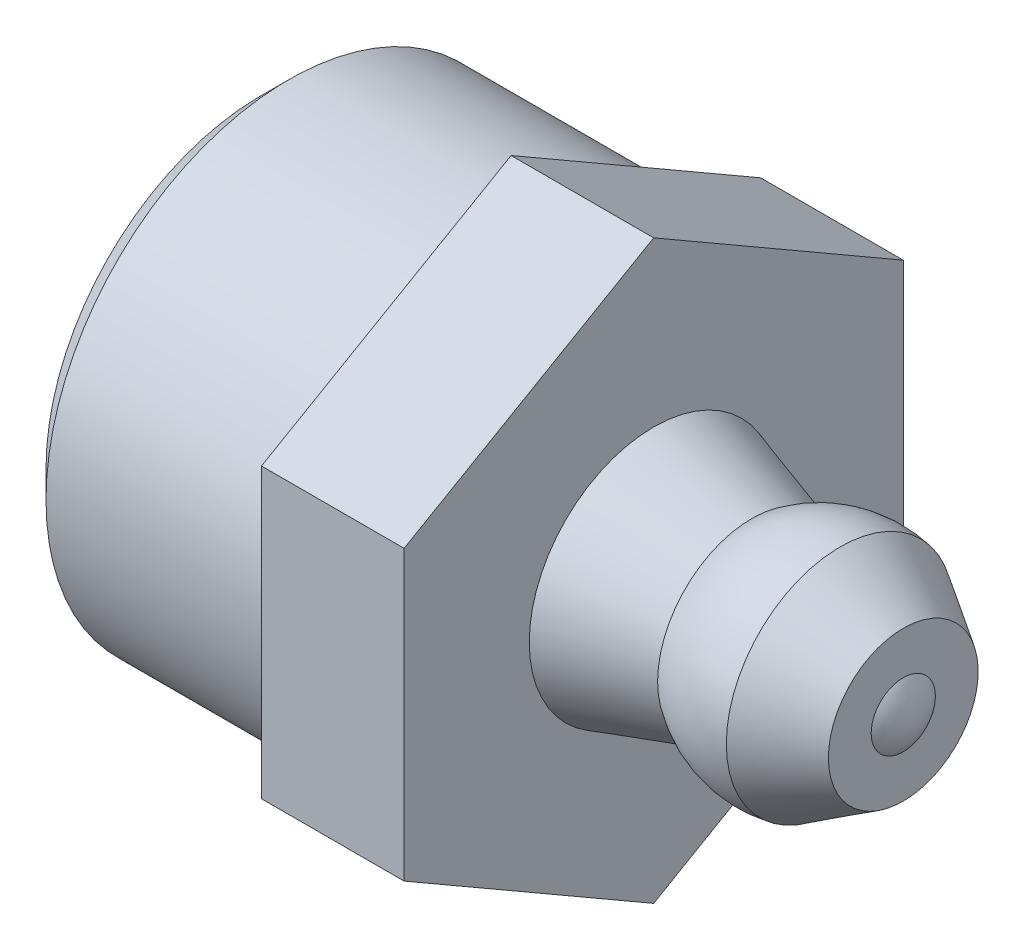
ISO-10303-21;
HEADER;
FILE_DESCRIPTION(('STEP AP214'),'2;1');
FILE_NAME('part.step','',(''),(''),'','','');
FILE_SCHEMA(('AUTOMOTIVE_DESIGN { 1 0 10303 214 1 1 1 1 }'));
ENDSEC;
DATA;
#1=APPLICATION_CONTEXT('core data for automotive mechanical design processes');
#2=APPLICATION_PROTOCOL_DEFINITION('international standard','automotive_design',2000,#1);
#3=PRODUCT_CONTEXT('',#1,'mechanical');
#4=PRODUCT('Part','Part','',(#3));
#5=PRODUCT_RELATED_PRODUCT_CATEGORY('part','',(#4));
#6=PRODUCT_DEFINITION_FORMATION('','',#4);
#7=PRODUCT_DEFINITION_CONTEXT('part definition',#1,'design');
#8=PRODUCT_DEFINITION('design','',#6,#7);
#9=PRODUCT_DEFINITION_SHAPE('','',#8);
#10=(LENGTH_UNIT() NAMED_UNIT(*) SI_UNIT(.MILLI.,.METRE.));
#11=(NAMED_UNIT(*) PLANE_ANGLE_UNIT() SI_UNIT($,.RADIAN.));
#12=(NAMED_UNIT(*) SI_UNIT($,.STERADIAN.) SOLID_ANGLE_UNIT());
#13=UNCERTAINTY_MEASURE_WITH_UNIT(LENGTH_MEASURE(1.E-05),#10,'distance_accuracy_value','');
#14=(GEOMETRIC_REPRESENTATION_CONTEXT(3) GLOBAL_UNCERTAINTY_ASSIGNED_CONTEXT((#13)) GLOBAL_UNIT_ASSIGNED_CONTEXT((#10,
#11,#12)) REPRESENTATION_CONTEXT('',''));
#15=CARTESIAN_POINT('',(0.,0.,0.));
#16=DIRECTION('',(0.,0.,1.));
#17=DIRECTION('',(1.,0.,0.));
#18=AXIS2_PLACEMENT_3D('',#15,#16,#17);
#19=CARTESIAN_POINT('',(9.80000000000003,0.,0.));
#20=DIRECTION('',(-1.,0.,0.));
#21=DIRECTION('',(0.,1.,0.));
#22=AXIS2_PLACEMENT_3D('',#19,#20,#21);
#23=SPHERICAL_SURFACE('',#22,1.5);
#24=CARTESIAN_POINT('',(10.9999999999999,0.,0.));
#25=DIRECTION('',(-1.,0.,0.));
#26=DIRECTION('',(0.,0.,1.));
#27=AXIS2_PLACEMENT_3D('',#24,#25,#26);
#28=CIRCLE('',#27,0.9);
#29=CARTESIAN_POINT('',(10.9999999999999,0.,0.9));
#30=VERTEX_POINT('',#29);
#31=EDGE_CURVE('E11',#30,#30,#28,.T.);
#32=ORIENTED_EDGE('',*,*,#31,.F.);
#33=EDGE_LOOP('',(#32));
#34=FACE_BOUND('',#33,.T.);
#35=ADVANCED_FACE('F17',(#34),#23,.T.);
#36=CARTESIAN_POINT('',(10.9999999999999,0.900000000000012,0.));
#37=DIRECTION('',(-1.,0.,0.));
#38=DIRECTION('',(0.,0.,1.));
#39=AXIS2_PLACEMENT_3D('',#36,#37,#38);
#40=PLANE('',#39);
#41=CARTESIAN_POINT('',(10.9999999999999,0.,0.));
#42=DIRECTION('',(-1.,0.,0.));
#43=DIRECTION('',(0.,0.,1.));
#44=AXIS2_PLACEMENT_3D('',#41,#42,#43);
#45=CIRCLE('',#44,2.1);
#46=CARTESIAN_POINT('',(10.9999999999999,0.,2.1));
#47=VERTEX_POINT('',#46);
#48=EDGE_CURVE('E26',#47,#47,#45,.T.);
#49=ORIENTED_EDGE('',*,*,#48,.F.);
#50=EDGE_LOOP('',(#49));
#51=FACE_BOUND('',#50,.T.);
#52=ORIENTED_EDGE('',*,*,#31,.T.);
#53=EDGE_LOOP('',(#52));
#54=FACE_BOUND('',#53,.T.);
#55=ADVANCED_FACE('F138',(#51,#54),#40,.F.);
#56=CARTESIAN_POINT('',(10.9999999999999,0.,0.));
#57=DIRECTION('',(-1.,0.,0.));
#58=DIRECTION('',(0.,0.,1.));
#59=AXIS2_PLACEMENT_3D('',#56,#57,#58);
#60=CONICAL_SURFACE('',#59,2.1,0.554038706826685);
#61=CARTESIAN_POINT('',(9.23148877199997,0.,0.));
#62=DIRECTION('',(-1.,0.,0.));
#63=DIRECTION('',(0.,0.,1.));
#64=AXIS2_PLACEMENT_3D('',#61,#62,#63);
#65=CIRCLE('',#64,3.194135251);
#66=CARTESIAN_POINT('',(9.23148877199997,0.,3.194135251));
#67=VERTEX_POINT('',#66);
#68=EDGE_CURVE('E126',#67,#67,#65,.T.);
#69=ORIENTED_EDGE('',*,*,#68,.F.);
#70=EDGE_LOOP('',(#69));
#71=FACE_BOUND('',#70,.T.);
#72=ORIENTED_EDGE('',*,*,#48,.T.);
#73=EDGE_LOOP('',(#72));
#74=FACE_BOUND('',#73,.T.);
#75=ADVANCED_FACE('F136',(#71,#74),#60,.T.);
#76=CARTESIAN_POINT('',(8.64260971425135,0.,0.));
#77=DIRECTION('',(-1.,0.,0.));
#78=DIRECTION('',(0.,0.,1.));
#79=AXIS2_PLACEMENT_3D('',#76,#77,#78);
#80=DEGENERATE_TOROIDAL_SURFACE('',#79,0.00206897516345217,3.25,.F.);
#81=CARTESIAN_POINT('',(6.75000000000003,0.,0.));
#82=DIRECTION('',(-1.,0.,0.));
#83=DIRECTION('',(0.,0.,1.));
#84=AXIS2_PLACEMENT_3D('',#81,#82,#83);
#85=CIRCLE('',#84,2.64);
#86=CARTESIAN_POINT('',(6.75000000000003,0.,2.64));
#87=VERTEX_POINT('',#86);
#88=EDGE_CURVE('E122',#87,#87,#85,.T.);
#89=ORIENTED_EDGE('',*,*,#88,.F.);
#90=EDGE_LOOP('',(#89));
#91=FACE_BOUND('',#90,.T.);
#92=ORIENTED_EDGE('',*,*,#68,.T.);
#93=EDGE_LOOP('',(#92));
#94=FACE_BOUND('',#93,.T.);
#95=ADVANCED_FACE('F151',(#91,#94),#80,.F.);
#96=CARTESIAN_POINT('',(4.,0.,0.));
#97=DIRECTION('',(-1.,0.,0.));
#98=DIRECTION('',(0.,0.,1.));
#99=AXIS2_PLACEMENT_3D('',#96,#97,#98);
#100=CONICAL_SURFACE('',#99,3.49,0.29977607009998);
#101=ORIENTED_EDGE('',*,*,#88,.T.);
#102=EDGE_LOOP('',(#101));
#103=FACE_BOUND('',#102,.T.);
#104=CARTESIAN_POINT('',(4.,0.,0.));
#105=DIRECTION('',(-1.,0.,0.));
#106=DIRECTION('',(0.,0.,1.));
#107=AXIS2_PLACEMENT_3D('',#104,#105,#106);
#108=CIRCLE('',#107,3.49);
#109=CARTESIAN_POINT('',(4.,0.,3.49));
#110=VERTEX_POINT('',#109);
#111=EDGE_CURVE('E118',#110,#110,#108,.T.);
#112=ORIENTED_EDGE('',*,*,#111,.F.);
#113=EDGE_LOOP('',(#112));
#114=FACE_BOUND('',#113,.T.);
#115=ADVANCED_FACE('F155',(#103,#114),#100,.T.);
#116=CARTESIAN_POINT('',(4.,7.00000000000001,0.));
#117=DIRECTION('',(1.,0.,0.));
#118=DIRECTION('',(0.,0.,-1.));
#119=AXIS2_PLACEMENT_3D('',#116,#117,#118);
#120=PLANE('',#119);
#121=ORIENTED_EDGE('',*,*,#111,.T.);
#122=EDGE_LOOP('',(#121));
#123=FACE_BOUND('',#122,.T.);
#124=DIRECTION('',(0.,-0.5,0.866025403784439));
#125=VECTOR('',#124,1.);
#126=CARTESIAN_POINT('',(4.,8.08290376865475,0.));
#127=LINE('',#126,#125);
#128=CARTESIAN_POINT('',(4.,8.08290376865475,0.));
#129=VERTEX_POINT('',#128);
#130=CARTESIAN_POINT('',(4.,4.04145188432739,7.));
#131=VERTEX_POINT('',#130);
#132=EDGE_CURVE('E38',#129,#131,#127,.T.);
#133=ORIENTED_EDGE('',*,*,#132,.T.);
#134=DIRECTION('',(0.,-1.,0.));
#135=VECTOR('',#134,1.);
#136=CARTESIAN_POINT('',(4.,4.04145188432739,7.));
#137=LINE('',#136,#135);
#138=CARTESIAN_POINT('',(4.,-4.04145188432736,7.));
#139=VERTEX_POINT('',#138);
#140=EDGE_CURVE('E33',#131,#139,#137,.T.);
#141=ORIENTED_EDGE('',*,*,#140,.T.);
#142=DIRECTION('',(0.,-0.5,-0.866025403784438));
#143=VECTOR('',#142,1.);
#144=CARTESIAN_POINT('',(4.,-4.04145188432736,7.));
#145=LINE('',#144,#143);
#146=CARTESIAN_POINT('',(4.,-8.08290376865475,0.));
#147=VERTEX_POINT('',#146);
#148=EDGE_CURVE('E203',#139,#147,#145,.T.);
#149=ORIENTED_EDGE('',*,*,#148,.T.);
#150=DIRECTION('',(0.,0.5,-0.866025403784439));
#151=VECTOR('',#150,1.);
#152=CARTESIAN_POINT('',(4.,-8.08290376865475,0.));
#153=LINE('',#152,#151);
#154=CARTESIAN_POINT('',(4.,-4.04145188432739,-7.));
#155=VERTEX_POINT('',#154);
#156=EDGE_CURVE('E94',#147,#155,#153,.T.);
#157=ORIENTED_EDGE('',*,*,#156,.T.);
#158=DIRECTION('',(0.,1.,0.));
#159=VECTOR('',#158,1.);
#160=CARTESIAN_POINT('',(4.,-4.04145188432739,-7.));
#161=LINE('',#160,#159);
#162=CARTESIAN_POINT('',(4.,4.04145188432739,-7.));
#163=VERTEX_POINT('',#162);
#164=EDGE_CURVE('E218',#155,#163,#161,.T.);
#165=ORIENTED_EDGE('',*,*,#164,.T.);
#166=DIRECTION('',(0.,0.5,0.866025403784439));
#167=VECTOR('',#166,1.);
#168=CARTESIAN_POINT('',(4.,4.04145188432739,-7.));
#169=LINE('',#168,#167);
#170=EDGE_CURVE('E221',#163,#129,#169,.T.);
#171=ORIENTED_EDGE('',*,*,#170,.T.);
#172=EDGE_LOOP('',(#133,#141,#149,#157,#165,#171));
#173=FACE_BOUND('',#172,.T.);
#174=ADVANCED_FACE('F159',(#123,#173),#120,.T.);
#175=CARTESIAN_POINT('',(4.,-4.04145188432736,7.));
#176=DIRECTION('',(0.,0.866025403784438,-0.5));
#177=DIRECTION('',(0.,0.5,0.866025403784439));
#178=AXIS2_PLACEMENT_3D('',#175,#176,#177);
#179=PLANE('',#178);
#180=DIRECTION('',(0.,-0.5,-0.866025403784438));
#181=VECTOR('',#180,1.);
#182=CARTESIAN_POINT('',(0.,-4.04145188432736,7.));
#183=LINE('',#182,#181);
#184=CARTESIAN_POINT('',(0.,-4.04145188432736,7.));
#185=VERTEX_POINT('',#184);
#186=CARTESIAN_POINT('',(0.,-8.08290376865475,0.));
#187=VERTEX_POINT('',#186);
#188=EDGE_CURVE('E70',#185,#187,#183,.T.);
#189=ORIENTED_EDGE('',*,*,#188,.T.);
#190=DIRECTION('',(-1.,0.,0.));
#191=VECTOR('',#190,1.);
#192=CARTESIAN_POINT('',(4.,-8.08290376865475,0.));
#193=LINE('',#192,#191);
#194=EDGE_CURVE('E75',#147,#187,#193,.T.);
#195=ORIENTED_EDGE('',*,*,#194,.F.);
#196=ORIENTED_EDGE('',*,*,#148,.F.);
#197=DIRECTION('',(-1.,0.,0.));
#198=VECTOR('',#197,1.);
#199=CARTESIAN_POINT('',(4.,-4.04145188432736,7.));
#200=LINE('',#199,#198);
#201=EDGE_CURVE('E76',#139,#185,#200,.T.);
#202=ORIENTED_EDGE('',*,*,#201,.T.);
#203=EDGE_LOOP('',(#189,#195,#196,#202));
#204=FACE_BOUND('',#203,.T.);
#205=ADVANCED_FACE('F72',(#204),#179,.F.);
#206=CARTESIAN_POINT('',(4.,-8.08290376865475,0.));
#207=DIRECTION('',(0.,0.866025403784439,0.5));
#208=DIRECTION('',(0.,-0.5,0.866025403784439));
#209=AXIS2_PLACEMENT_3D('',#206,#207,#208);
#210=PLANE('',#209);
#211=DIRECTION('',(0.,0.5,-0.866025403784439));
#212=VECTOR('',#211,1.);
#213=CARTESIAN_POINT('',(0.,-8.08290376865475,0.));
#214=LINE('',#213,#212);
#215=CARTESIAN_POINT('',(0.,-4.04145188432739,-7.));
#216=VERTEX_POINT('',#215);
#217=EDGE_CURVE('E80',#187,#216,#214,.T.);
#218=ORIENTED_EDGE('',*,*,#217,.T.);
#219=DIRECTION('',(-1.,0.,0.));
#220=VECTOR('',#219,1.);
#221=CARTESIAN_POINT('',(4.,-4.04145188432739,-7.));
#222=LINE('',#221,#220);
#223=EDGE_CURVE('E97',#155,#216,#222,.T.);
#224=ORIENTED_EDGE('',*,*,#223,.F.);
#225=ORIENTED_EDGE('',*,*,#156,.F.);
#226=ORIENTED_EDGE('',*,*,#194,.T.);
#227=EDGE_LOOP('',(#218,#224,#225,#226));
#228=FACE_BOUND('',#227,.T.);
#229=ADVANCED_FACE('F93',(#228),#210,.F.);
#230=CARTESIAN_POINT('',(4.,-4.04145188432739,-7.));
#231=DIRECTION('',(0.,0.,1.));
#232=DIRECTION('',(0.,-1.,0.));
#233=AXIS2_PLACEMENT_3D('',#230,#231,#232);
#234=PLANE('',#233);
#235=DIRECTION('',(0.,1.,0.));
#236=VECTOR('',#235,1.);
#237=CARTESIAN_POINT('',(0.,-4.04145188432739,-7.));
#238=LINE('',#237,#236);
#239=CARTESIAN_POINT('',(0.,4.04145188432739,-7.));
#240=VERTEX_POINT('',#239);
#241=EDGE_CURVE('E86',#216,#240,#238,.T.);
#242=ORIENTED_EDGE('',*,*,#241,.T.);
#243=DIRECTION('',(-1.,0.,0.));
#244=VECTOR('',#243,1.);
#245=CARTESIAN_POINT('',(4.,4.04145188432739,-7.));
#246=LINE('',#245,#244);
#247=EDGE_CURVE('E107',#163,#240,#246,.T.);
#248=ORIENTED_EDGE('',*,*,#247,.F.);
#249=ORIENTED_EDGE('',*,*,#164,.F.);
#250=ORIENTED_EDGE('',*,*,#223,.T.);
#251=EDGE_LOOP('',(#242,#248,#249,#250));
#252=FACE_BOUND('',#251,.T.);
#253=ADVANCED_FACE('F178',(#252),#234,.F.);
#254=CARTESIAN_POINT('',(4.,4.04145188432739,-7.));
#255=DIRECTION('',(0.,-0.866025403784439,0.5));
#256=DIRECTION('',(0.,-0.5,-0.866025403784439));
#257=AXIS2_PLACEMENT_3D('',#254,#255,#256);
#258=PLANE('',#257);
#259=DIRECTION('',(0.,0.5,0.866025403784439));
#260=VECTOR('',#259,1.);
#261=CARTESIAN_POINT('',(0.,4.04145188432739,-7.));
#262=LINE('',#261,#260);
#263=CARTESIAN_POINT('',(0.,8.08290376865475,0.));
#264=VERTEX_POINT('',#263);
#265=EDGE_CURVE('E212',#240,#264,#262,.T.);
#266=ORIENTED_EDGE('',*,*,#265,.T.);
#267=DIRECTION('',(-1.,0.,0.));
#268=VECTOR('',#267,1.);
#269=CARTESIAN_POINT('',(4.,8.08290376865475,0.));
#270=LINE('',#269,#268);
#271=EDGE_CURVE('E231',#129,#264,#270,.T.);
#272=ORIENTED_EDGE('',*,*,#271,.F.);
#273=ORIENTED_EDGE('',*,*,#170,.F.);
#274=ORIENTED_EDGE('',*,*,#247,.T.);
#275=EDGE_LOOP('',(#266,#272,#273,#274));
#276=FACE_BOUND('',#275,.T.);
#277=ADVANCED_FACE('F181',(#276),#258,.F.);
#278=CARTESIAN_POINT('',(4.,8.08290376865475,0.));
#279=DIRECTION('',(0.,-0.866025403784439,-0.5));
#280=DIRECTION('',(0.,0.5,-0.866025403784439));
#281=AXIS2_PLACEMENT_3D('',#278,#279,#280);
#282=PLANE('',#281);
#283=DIRECTION('',(0.,-0.5,0.866025403784439));
#284=VECTOR('',#283,1.);
#285=CARTESIAN_POINT('',(0.,8.08290376865475,0.));
#286=LINE('',#285,#284);
#287=CARTESIAN_POINT('',(0.,4.04145188432739,7.));
#288=VERTEX_POINT('',#287);
#289=EDGE_CURVE('E204',#264,#288,#286,.T.);
#290=ORIENTED_EDGE('',*,*,#289,.T.);
#291=DIRECTION('',(-1.,0.,0.));
#292=VECTOR('',#291,1.);
#293=CARTESIAN_POINT('',(4.,4.04145188432739,7.));
#294=LINE('',#293,#292);
#295=EDGE_CURVE('E200',#131,#288,#294,.T.);
#296=ORIENTED_EDGE('',*,*,#295,.F.);
#297=ORIENTED_EDGE('',*,*,#132,.F.);
#298=ORIENTED_EDGE('',*,*,#271,.T.);
#299=EDGE_LOOP('',(#290,#296,#297,#298));
#300=FACE_BOUND('',#299,.T.);
#301=ADVANCED_FACE('F185',(#300),#282,.F.);
#302=CARTESIAN_POINT('',(4.,4.04145188432739,7.));
#303=DIRECTION('',(0.,0.,-1.));
#304=DIRECTION('',(0.,1.,0.));
#305=AXIS2_PLACEMENT_3D('',#302,#303,#304);
#306=PLANE('',#305);
#307=DIRECTION('',(0.,-1.,0.));
#308=VECTOR('',#307,1.);
#309=CARTESIAN_POINT('',(0.,4.04145188432739,7.));
#310=LINE('',#309,#308);
#311=EDGE_CURVE('E198',#288,#185,#310,.T.);
#312=ORIENTED_EDGE('',*,*,#311,.T.);
#313=ORIENTED_EDGE('',*,*,#201,.F.);
#314=ORIENTED_EDGE('',*,*,#140,.F.);
#315=ORIENTED_EDGE('',*,*,#295,.T.);
#316=EDGE_LOOP('',(#312,#313,#314,#315));
#317=FACE_BOUND('',#316,.T.);
#318=ADVANCED_FACE('F189',(#317),#306,.F.);
#319=CARTESIAN_POINT('',(-7.00000000000001,0.,0.));
#320=DIRECTION('',(-1.,0.,0.));
#321=DIRECTION('',(0.,0.,1.));
#322=AXIS2_PLACEMENT_3D('',#319,#320,#321);
#323=PLANE('',#322);
#324=CARTESIAN_POINT('',(-7.00000000000001,0.,0.));
#325=DIRECTION('',(-1.,0.,0.));
#326=DIRECTION('',(0.,0.,1.));
#327=AXIS2_PLACEMENT_3D('',#324,#325,#326);
#328=CIRCLE('',#327,6.044273674);
#329=CARTESIAN_POINT('',(-7.00000000000001,0.,6.044273674));
#330=VERTEX_POINT('',#329);
#331=EDGE_CURVE('E96',#330,#330,#328,.T.);
#332=ORIENTED_EDGE('',*,*,#331,.T.);
#333=EDGE_LOOP('',(#332));
#334=FACE_BOUND('',#333,.T.);
#335=ADVANCED_FACE('F19',(#334),#323,.T.);
#336=CARTESIAN_POINT('',(-7.00000000000001,0.,0.));
#337=DIRECTION('',(1.,0.,0.));
#338=DIRECTION('',(0.,0.,-1.));
#339=AXIS2_PLACEMENT_3D('',#336,#337,#338);
#340=CONICAL_SURFACE('',#339,6.044273674,0.785398163397448);
#341=CARTESIAN_POINT('',(-6.23627367400004,0.,0.));
#342=DIRECTION('',(-1.,0.,0.));
#343=DIRECTION('',(0.,0.,1.));
#344=AXIS2_PLACEMENT_3D('',#341,#342,#343);
#345=CIRCLE('',#344,6.808);
#346=CARTESIAN_POINT('',(-6.23627367400004,0.,6.808));
#347=VERTEX_POINT('',#346);
#348=EDGE_CURVE('E104',#347,#347,#345,.T.);
#349=ORIENTED_EDGE('',*,*,#348,.T.);
#350=EDGE_LOOP('',(#349));
#351=FACE_BOUND('',#350,.T.);
#352=ORIENTED_EDGE('',*,*,#331,.F.);
#353=EDGE_LOOP('',(#352));
#354=FACE_BOUND('',#353,.T.);
#355=ADVANCED_FACE('F169',(#351,#354),#340,.T.);
#356=CARTESIAN_POINT('',(0.,0.,0.));
#357=DIRECTION('',(-1.,0.,0.));
#358=DIRECTION('',(0.,0.,1.));
#359=AXIS2_PLACEMENT_3D('',#356,#357,#358);
#360=CYLINDRICAL_SURFACE('',#359,6.808);
#361=CARTESIAN_POINT('',(0.,0.,0.));
#362=DIRECTION('',(-1.,0.,0.));
#363=DIRECTION('',(0.,0.,1.));
#364=AXIS2_PLACEMENT_3D('',#361,#362,#363);
#365=CIRCLE('',#364,6.808);
#366=CARTESIAN_POINT('',(0.,0.,6.808));
#367=VERTEX_POINT('',#366);
#368=EDGE_CURVE('E114',#367,#367,#365,.T.);
#369=ORIENTED_EDGE('',*,*,#368,.T.);
#370=EDGE_LOOP('',(#369));
#371=FACE_BOUND('',#370,.T.);
#372=ORIENTED_EDGE('',*,*,#348,.F.);
#373=EDGE_LOOP('',(#372));
#374=FACE_BOUND('',#373,.T.);
#375=ADVANCED_FACE('F166',(#371,#374),#360,.T.);
#376=CARTESIAN_POINT('',(0.,6.80800000000001,0.));
#377=DIRECTION('',(-1.,0.,0.));
#378=DIRECTION('',(0.,0.,1.));
#379=AXIS2_PLACEMENT_3D('',#376,#377,#378);
#380=PLANE('',#379);
#381=ORIENTED_EDGE('',*,*,#311,.F.);
#382=ORIENTED_EDGE('',*,*,#289,.F.);
#383=ORIENTED_EDGE('',*,*,#265,.F.);
#384=ORIENTED_EDGE('',*,*,#241,.F.);
#385=ORIENTED_EDGE('',*,*,#217,.F.);
#386=ORIENTED_EDGE('',*,*,#188,.F.);
#387=EDGE_LOOP('',(#381,#382,#383,#384,#385,#386));
#388=FACE_BOUND('',#387,.T.);
#389=ORIENTED_EDGE('',*,*,#368,.F.);
#390=EDGE_LOOP('',(#389));
#391=FACE_BOUND('',#390,.T.);
#392=ADVANCED_FACE('F83',(#388,#391),#380,.T.);
#393=CLOSED_SHELL('',(#35,#55,#75,#95,#115,#174,#205,#229,#253,#277,#301,#318,#335,#355,#375,#392));
#394=MANIFOLD_SOLID_BREP('B1',#393);
#395=ADVANCED_BREP_SHAPE_REPRESENTATION('',(#18,#394),#14);
#396=SHAPE_DEFINITION_REPRESENTATION(#9,#395);
ENDSEC;
END-ISO-10303-21;
